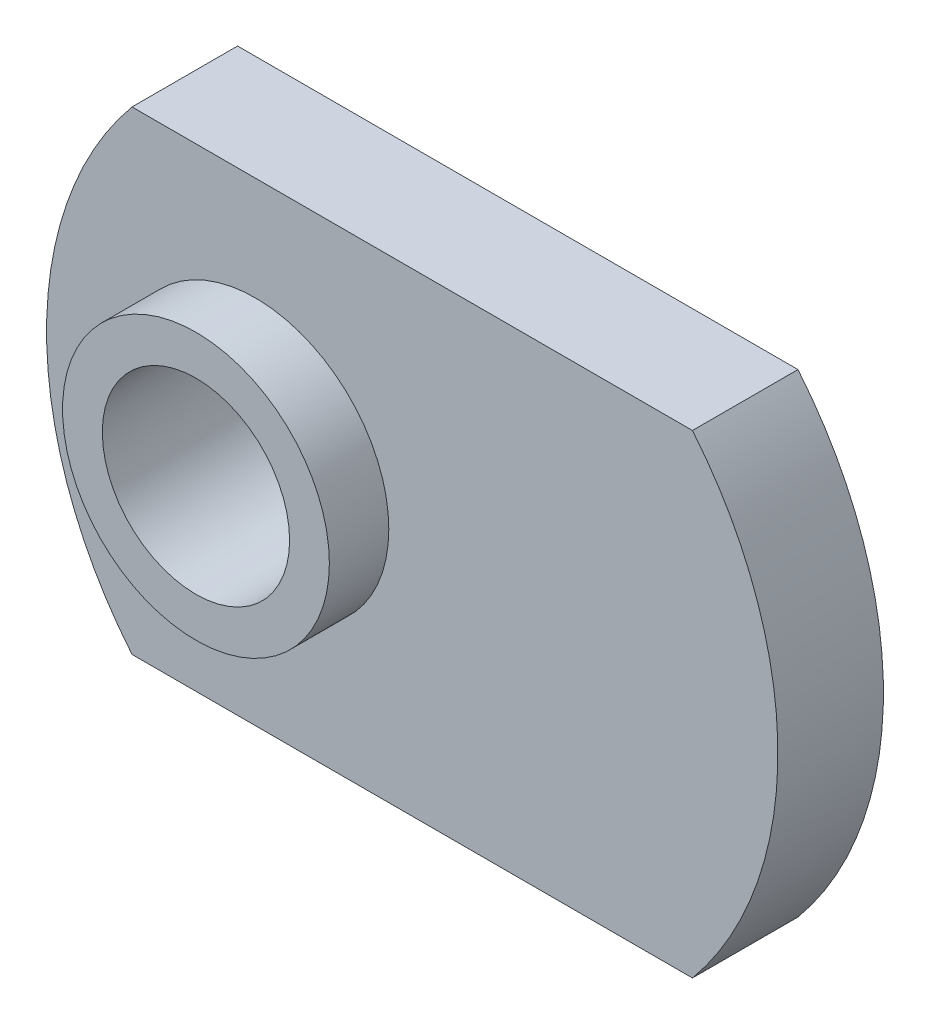
ISO-10303-21;
HEADER;
FILE_DESCRIPTION(('STEP AP214'),'2;1');
FILE_NAME('part.step','',(''),(''),'','','');
FILE_SCHEMA(('AUTOMOTIVE_DESIGN { 1 0 10303 214 1 1 1 1 }'));
ENDSEC;
DATA;
#1=APPLICATION_CONTEXT('core data for automotive mechanical design processes');
#2=APPLICATION_PROTOCOL_DEFINITION('international standard','automotive_design',2000,#1);
#3=PRODUCT_CONTEXT('',#1,'mechanical');
#4=PRODUCT('Part','Part','',(#3));
#5=PRODUCT_RELATED_PRODUCT_CATEGORY('part','',(#4));
#6=PRODUCT_DEFINITION_FORMATION('','',#4);
#7=PRODUCT_DEFINITION_CONTEXT('part definition',#1,'design');
#8=PRODUCT_DEFINITION('design','',#6,#7);
#9=PRODUCT_DEFINITION_SHAPE('','',#8);
#10=(LENGTH_UNIT() NAMED_UNIT(*) SI_UNIT(.MILLI.,.METRE.));
#11=(NAMED_UNIT(*) PLANE_ANGLE_UNIT() SI_UNIT($,.RADIAN.));
#12=(NAMED_UNIT(*) SI_UNIT($,.STERADIAN.) SOLID_ANGLE_UNIT());
#13=UNCERTAINTY_MEASURE_WITH_UNIT(LENGTH_MEASURE(1.E-05),#10,'distance_accuracy_value','');
#14=(GEOMETRIC_REPRESENTATION_CONTEXT(3) GLOBAL_UNCERTAINTY_ASSIGNED_CONTEXT((#13)) GLOBAL_UNIT_ASSIGNED_CONTEXT((#10,
#11,#12)) REPRESENTATION_CONTEXT('',''));
#15=CARTESIAN_POINT('',(0.,0.,0.));
#16=DIRECTION('',(0.,0.,1.));
#17=DIRECTION('',(1.,0.,0.));
#18=AXIS2_PLACEMENT_3D('',#15,#16,#17);
#19=CARTESIAN_POINT('',(-0.203200000000001,0.,-1.8034));
#20=DIRECTION('',(0.,0.,1.));
#21=DIRECTION('',(1.,0.,0.));
#22=AXIS2_PLACEMENT_3D('',#19,#20,#21);
#23=PLANE('',#22);
#24=CARTESIAN_POINT('',(-0.203200000000001,0.,-1.8034));
#25=DIRECTION('',(0.,0.,1.));
#26=DIRECTION('',(1.,0.,0.));
#27=AXIS2_PLACEMENT_3D('',#24,#25,#26);
#28=CIRCLE('',#27,12.7);
#29=CARTESIAN_POINT('',(9.57626180727754,-8.1026,-1.8034));
#30=VERTEX_POINT('',#29);
#31=CARTESIAN_POINT('',(9.57626180727754,8.1026,-1.8034));
#32=VERTEX_POINT('',#31);
#33=EDGE_CURVE('E93',#30,#32,#28,.T.);
#34=ORIENTED_EDGE('',*,*,#33,.F.);
#35=DIRECTION('',(1.,0.,0.));
#36=VECTOR('',#35,1.);
#37=CARTESIAN_POINT('',(-9.57626180727753,-8.1026,-1.8034));
#38=LINE('',#37,#36);
#39=CARTESIAN_POINT('',(-9.57626180727753,-8.1026,-1.8034));
#40=VERTEX_POINT('',#39);
#41=EDGE_CURVE('E90',#40,#30,#38,.T.);
#42=ORIENTED_EDGE('',*,*,#41,.F.);
#43=CARTESIAN_POINT('',(0.203199999999997,0.,-1.8034));
#44=DIRECTION('',(0.,0.,1.));
#45=DIRECTION('',(1.,0.,0.));
#46=AXIS2_PLACEMENT_3D('',#43,#44,#45);
#47=CIRCLE('',#46,12.7);
#48=CARTESIAN_POINT('',(-9.57626180727753,8.1026,-1.8034));
#49=VERTEX_POINT('',#48);
#50=EDGE_CURVE('E82',#49,#40,#47,.T.);
#51=ORIENTED_EDGE('',*,*,#50,.F.);
#52=DIRECTION('',(-1.,0.,0.));
#53=VECTOR('',#52,1.);
#54=CARTESIAN_POINT('',(9.57626180727754,8.1026,-1.8034));
#55=LINE('',#54,#53);
#56=EDGE_CURVE('E89',#32,#49,#55,.T.);
#57=ORIENTED_EDGE('',*,*,#56,.F.);
#58=EDGE_LOOP('',(#34,#42,#51,#57));
#59=FACE_BOUND('',#58,.T.);
#60=CARTESIAN_POINT('',(-5.3594,0.,-1.8034));
#61=DIRECTION('',(0.,0.,-1.));
#62=DIRECTION('',(-1.,0.,0.));
#63=AXIS2_PLACEMENT_3D('',#60,#61,#62);
#64=CIRCLE('',#63,3.20040000000001);
#65=CARTESIAN_POINT('',(-8.55980000000001,0.,-1.8034));
#66=VERTEX_POINT('',#65);
#67=EDGE_CURVE('E143',#66,#66,#64,.T.);
#68=ORIENTED_EDGE('',*,*,#67,.F.);
#69=EDGE_LOOP('',(#68));
#70=FACE_BOUND('',#69,.T.);
#71=ADVANCED_FACE('F32',(#59,#70),#23,.F.);
#72=CARTESIAN_POINT('',(-0.203200000000001,0.,-1.8034));
#73=DIRECTION('',(0.,0.,1.));
#74=DIRECTION('',(1.,0.,0.));
#75=AXIS2_PLACEMENT_3D('',#72,#73,#74);
#76=CYLINDRICAL_SURFACE('',#75,12.7);
#77=CARTESIAN_POINT('',(-0.203200000000001,0.,1.8034));
#78=DIRECTION('',(0.,0.,1.));
#79=DIRECTION('',(1.,0.,0.));
#80=AXIS2_PLACEMENT_3D('',#77,#78,#79);
#81=CIRCLE('',#80,12.7);
#82=CARTESIAN_POINT('',(9.57626180727754,-8.1026,1.8034));
#83=VERTEX_POINT('',#82);
#84=CARTESIAN_POINT('',(9.57626180727754,8.1026,1.8034));
#85=VERTEX_POINT('',#84);
#86=EDGE_CURVE('E100',#83,#85,#81,.T.);
#87=ORIENTED_EDGE('',*,*,#86,.F.);
#88=DIRECTION('',(0.,0.,1.));
#89=VECTOR('',#88,1.);
#90=CARTESIAN_POINT('',(9.57626180727754,-8.1026,-1.8034));
#91=LINE('',#90,#89);
#92=EDGE_CURVE('E41',#30,#83,#91,.T.);
#93=ORIENTED_EDGE('',*,*,#92,.F.);
#94=ORIENTED_EDGE('',*,*,#33,.T.);
#95=DIRECTION('',(0.,0.,1.));
#96=VECTOR('',#95,1.);
#97=CARTESIAN_POINT('',(9.57626180727754,8.1026,-1.8034));
#98=LINE('',#97,#96);
#99=EDGE_CURVE('E76',#32,#85,#98,.T.);
#100=ORIENTED_EDGE('',*,*,#99,.T.);
#101=EDGE_LOOP('',(#87,#93,#94,#100));
#102=FACE_BOUND('',#101,.T.);
#103=ADVANCED_FACE('F34',(#102),#76,.T.);
#104=CARTESIAN_POINT('',(-9.57626180727753,-8.1026,-1.8034));
#105=DIRECTION('',(0.,-1.,0.));
#106=DIRECTION('',(0.,0.,-1.));
#107=AXIS2_PLACEMENT_3D('',#104,#105,#106);
#108=PLANE('',#107);
#109=DIRECTION('',(1.,0.,0.));
#110=VECTOR('',#109,1.);
#111=CARTESIAN_POINT('',(-9.57626180727753,-8.1026,1.8034));
#112=LINE('',#111,#110);
#113=CARTESIAN_POINT('',(-9.57626180727753,-8.1026,1.8034));
#114=VERTEX_POINT('',#113);
#115=EDGE_CURVE('E95',#114,#83,#112,.T.);
#116=ORIENTED_EDGE('',*,*,#115,.F.);
#117=DIRECTION('',(0.,0.,1.));
#118=VECTOR('',#117,1.);
#119=CARTESIAN_POINT('',(-9.57626180727753,-8.1026,-1.8034));
#120=LINE('',#119,#118);
#121=EDGE_CURVE('E65',#40,#114,#120,.T.);
#122=ORIENTED_EDGE('',*,*,#121,.F.);
#123=ORIENTED_EDGE('',*,*,#41,.T.);
#124=ORIENTED_EDGE('',*,*,#92,.T.);
#125=EDGE_LOOP('',(#116,#122,#123,#124));
#126=FACE_BOUND('',#125,.T.);
#127=ADVANCED_FACE('F112',(#126),#108,.T.);
#128=CARTESIAN_POINT('',(0.203199999999997,0.,-1.8034));
#129=DIRECTION('',(0.,0.,1.));
#130=DIRECTION('',(1.,0.,0.));
#131=AXIS2_PLACEMENT_3D('',#128,#129,#130);
#132=CYLINDRICAL_SURFACE('',#131,12.7);
#133=CARTESIAN_POINT('',(0.203199999999997,0.,1.8034));
#134=DIRECTION('',(0.,0.,1.));
#135=DIRECTION('',(1.,0.,0.));
#136=AXIS2_PLACEMENT_3D('',#133,#134,#135);
#137=CIRCLE('',#136,12.7);
#138=CARTESIAN_POINT('',(-9.57626180727753,8.1026,1.8034));
#139=VERTEX_POINT('',#138);
#140=EDGE_CURVE('E84',#139,#114,#137,.T.);
#141=ORIENTED_EDGE('',*,*,#140,.F.);
#142=DIRECTION('',(0.,0.,1.));
#143=VECTOR('',#142,1.);
#144=CARTESIAN_POINT('',(-9.57626180727753,8.1026,-1.8034));
#145=LINE('',#144,#143);
#146=EDGE_CURVE('E79',#49,#139,#145,.T.);
#147=ORIENTED_EDGE('',*,*,#146,.F.);
#148=ORIENTED_EDGE('',*,*,#50,.T.);
#149=ORIENTED_EDGE('',*,*,#121,.T.);
#150=EDGE_LOOP('',(#141,#147,#148,#149));
#151=FACE_BOUND('',#150,.T.);
#152=ADVANCED_FACE('F81',(#151),#132,.T.);
#153=CARTESIAN_POINT('',(9.57626180727754,8.1026,-1.8034));
#154=DIRECTION('',(0.,1.,0.));
#155=DIRECTION('',(0.,0.,1.));
#156=AXIS2_PLACEMENT_3D('',#153,#154,#155);
#157=PLANE('',#156);
#158=DIRECTION('',(-1.,0.,0.));
#159=VECTOR('',#158,1.);
#160=CARTESIAN_POINT('',(9.57626180727754,8.1026,1.8034));
#161=LINE('',#160,#159);
#162=EDGE_CURVE('E103',#85,#139,#161,.T.);
#163=ORIENTED_EDGE('',*,*,#162,.F.);
#164=ORIENTED_EDGE('',*,*,#99,.F.);
#165=ORIENTED_EDGE('',*,*,#56,.T.);
#166=ORIENTED_EDGE('',*,*,#146,.T.);
#167=EDGE_LOOP('',(#163,#164,#165,#166));
#168=FACE_BOUND('',#167,.T.);
#169=ADVANCED_FACE('F92',(#168),#157,.T.);
#170=CARTESIAN_POINT('',(-0.203200000000001,0.,1.8034));
#171=DIRECTION('',(0.,0.,1.));
#172=DIRECTION('',(1.,0.,0.));
#173=AXIS2_PLACEMENT_3D('',#170,#171,#172);
#174=PLANE('',#173);
#175=CARTESIAN_POINT('',(-5.3594,0.,1.8034));
#176=DIRECTION('',(0.,0.,1.));
#177=DIRECTION('',(1.,0.,0.));
#178=AXIS2_PLACEMENT_3D('',#175,#176,#177);
#179=CIRCLE('',#178,4.5593);
#180=CARTESIAN_POINT('',(-0.800099999999998,0.,1.8034));
#181=VERTEX_POINT('',#180);
#182=EDGE_CURVE('E11',#181,#181,#179,.T.);
#183=ORIENTED_EDGE('',*,*,#182,.F.);
#184=EDGE_LOOP('',(#183));
#185=FACE_BOUND('',#184,.T.);
#186=ORIENTED_EDGE('',*,*,#86,.T.);
#187=ORIENTED_EDGE('',*,*,#162,.T.);
#188=ORIENTED_EDGE('',*,*,#140,.T.);
#189=ORIENTED_EDGE('',*,*,#115,.T.);
#190=EDGE_LOOP('',(#186,#187,#188,#189));
#191=FACE_BOUND('',#190,.T.);
#192=ADVANCED_FACE('F111',(#185,#191),#174,.T.);
#193=CARTESIAN_POINT('',(-5.3594,0.,1.8034));
#194=DIRECTION('',(0.,0.,1.));
#195=DIRECTION('',(1.,0.,0.));
#196=AXIS2_PLACEMENT_3D('',#193,#194,#195);
#197=CYLINDRICAL_SURFACE('',#196,4.5593);
#198=ORIENTED_EDGE('',*,*,#182,.T.);
#199=EDGE_LOOP('',(#198));
#200=FACE_BOUND('',#199,.T.);
#201=CARTESIAN_POINT('',(-5.3594,0.,3.8354));
#202=DIRECTION('',(0.,0.,1.));
#203=DIRECTION('',(1.,0.,0.));
#204=AXIS2_PLACEMENT_3D('',#201,#202,#203);
#205=CIRCLE('',#204,4.5593);
#206=CARTESIAN_POINT('',(-0.800099999999998,0.,3.8354));
#207=VERTEX_POINT('',#206);
#208=EDGE_CURVE('E104',#207,#207,#205,.T.);
#209=ORIENTED_EDGE('',*,*,#208,.F.);
#210=EDGE_LOOP('',(#209));
#211=FACE_BOUND('',#210,.T.);
#212=ADVANCED_FACE('F126',(#200,#211),#197,.T.);
#213=CARTESIAN_POINT('',(-5.3594,0.,3.8354));
#214=DIRECTION('',(0.,0.,1.));
#215=DIRECTION('',(1.,0.,0.));
#216=AXIS2_PLACEMENT_3D('',#213,#214,#215);
#217=PLANE('',#216);
#218=CARTESIAN_POINT('',(-5.3594,0.,3.8354));
#219=DIRECTION('',(0.,0.,-1.));
#220=DIRECTION('',(-1.,0.,0.));
#221=AXIS2_PLACEMENT_3D('',#218,#219,#220);
#222=CIRCLE('',#221,3.20040000000001);
#223=CARTESIAN_POINT('',(-8.55980000000001,0.,3.8354));
#224=VERTEX_POINT('',#223);
#225=EDGE_CURVE('E141',#224,#224,#222,.T.);
#226=ORIENTED_EDGE('',*,*,#225,.T.);
#227=EDGE_LOOP('',(#226));
#228=FACE_BOUND('',#227,.T.);
#229=ORIENTED_EDGE('',*,*,#208,.T.);
#230=EDGE_LOOP('',(#229));
#231=FACE_BOUND('',#230,.T.);
#232=ADVANCED_FACE('F134',(#228,#231),#217,.T.);
#233=CARTESIAN_POINT('',(-5.3594,0.,-1.8034));
#234=DIRECTION('',(0.,0.,-1.));
#235=DIRECTION('',(-1.,0.,0.));
#236=AXIS2_PLACEMENT_3D('',#233,#234,#235);
#237=CYLINDRICAL_SURFACE('',#236,3.20040000000001);
#238=ORIENTED_EDGE('',*,*,#225,.F.);
#239=EDGE_LOOP('',(#238));
#240=FACE_BOUND('',#239,.T.);
#241=ORIENTED_EDGE('',*,*,#67,.T.);
#242=EDGE_LOOP('',(#241));
#243=FACE_BOUND('',#242,.T.);
#244=ADVANCED_FACE('F149',(#240,#243),#237,.F.);
#245=CLOSED_SHELL('',(#71,#103,#127,#152,#169,#192,#212,#232,#244));
#246=MANIFOLD_SOLID_BREP('B2',#245);
#247=ADVANCED_BREP_SHAPE_REPRESENTATION('',(#18,#246),#14);
#248=SHAPE_DEFINITION_REPRESENTATION(#9,#247);
ENDSEC;
END-ISO-10303-21;
